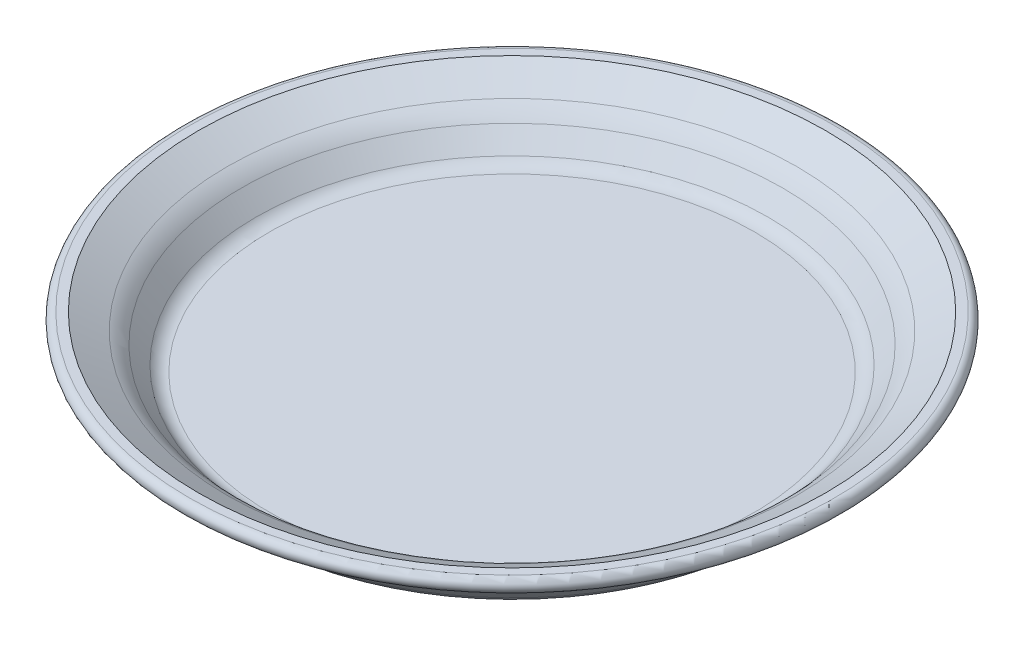
ISO-10303-21;
HEADER;
FILE_DESCRIPTION(('STEP AP214'),'2;1');
FILE_NAME('part.step','',(''),(''),'','','');
FILE_SCHEMA(('AUTOMOTIVE_DESIGN { 1 0 10303 214 1 1 1 1 }'));
ENDSEC;
DATA;
#1=APPLICATION_CONTEXT('core data for automotive mechanical design processes');
#2=APPLICATION_PROTOCOL_DEFINITION('international standard','automotive_design',2000,#1);
#3=PRODUCT_CONTEXT('',#1,'mechanical');
#4=PRODUCT('Part','Part','',(#3));
#5=PRODUCT_RELATED_PRODUCT_CATEGORY('part','',(#4));
#6=PRODUCT_DEFINITION_FORMATION('','',#4);
#7=PRODUCT_DEFINITION_CONTEXT('part definition',#1,'design');
#8=PRODUCT_DEFINITION('design','',#6,#7);
#9=PRODUCT_DEFINITION_SHAPE('','',#8);
#10=(LENGTH_UNIT() NAMED_UNIT(*) SI_UNIT(.MILLI.,.METRE.));
#11=(NAMED_UNIT(*) PLANE_ANGLE_UNIT() SI_UNIT($,.RADIAN.));
#12=(NAMED_UNIT(*) SI_UNIT($,.STERADIAN.) SOLID_ANGLE_UNIT());
#13=UNCERTAINTY_MEASURE_WITH_UNIT(LENGTH_MEASURE(1.E-05),#10,'distance_accuracy_value','');
#14=(GEOMETRIC_REPRESENTATION_CONTEXT(3) GLOBAL_UNCERTAINTY_ASSIGNED_CONTEXT((#13)) GLOBAL_UNIT_ASSIGNED_CONTEXT((#10,
#11,#12)) REPRESENTATION_CONTEXT('',''));
#15=CARTESIAN_POINT('',(0.,0.,0.));
#16=DIRECTION('',(0.,0.,1.));
#17=DIRECTION('',(1.,0.,0.));
#18=AXIS2_PLACEMENT_3D('',#15,#16,#17);
#19=CARTESIAN_POINT('',(0.,0.,0.));
#20=DIRECTION('',(0.,1.,0.));
#21=DIRECTION('',(0.,0.,1.));
#22=AXIS2_PLACEMENT_3D('',#19,#20,#21);
#23=CONICAL_SURFACE('',#22,100.,1.0471975511966);
#24=CARTESIAN_POINT('',(0.,-3.73205080756888,0.));
#25=DIRECTION('',(0.,-1.,0.));
#26=DIRECTION('',(0.,0.,-1.));
#27=AXIS2_PLACEMENT_3D('',#24,#25,#26);
#28=CIRCLE('',#27,93.5358983848622);
#29=CARTESIAN_POINT('',(0.,-3.73205080756888,-93.5358983848622));
#30=VERTEX_POINT('',#29);
#31=EDGE_CURVE('E10',#30,#30,#28,.T.);
#32=ORIENTED_EDGE('',*,*,#31,.T.);
#33=EDGE_LOOP('',(#32));
#34=FACE_BOUND('',#33,.T.);
#35=CARTESIAN_POINT('',(0.,-9.11836509645769,0.));
#36=DIRECTION('',(0.,-1.,0.));
#37=DIRECTION('',(0.,0.,-1.));
#38=AXIS2_PLACEMENT_3D('',#35,#36,#37);
#39=CIRCLE('',#38,84.2065283709725);
#40=CARTESIAN_POINT('',(0.,-9.11836509645769,-84.2065283709725));
#41=VERTEX_POINT('',#40);
#42=EDGE_CURVE('E48',#41,#41,#39,.F.);
#43=ORIENTED_EDGE('',*,*,#42,.T.);
#44=EDGE_LOOP('',(#43));
#45=FACE_BOUND('',#44,.T.);
#46=ADVANCED_FACE('F33',(#34,#45),#23,.T.);
#47=CARTESIAN_POINT('',(0.,0.,0.));
#48=DIRECTION('',(0.,1.,0.));
#49=DIRECTION('',(0.,0.,1.));
#50=AXIS2_PLACEMENT_3D('',#47,#48,#49);
#51=PLANE('',#50);
#52=CARTESIAN_POINT('',(0.,0.,0.));
#53=DIRECTION('',(0.,1.,0.));
#54=DIRECTION('',(0.,0.,1.));
#55=AXIS2_PLACEMENT_3D('',#52,#53,#54);
#56=CIRCLE('',#55,90.);
#57=CARTESIAN_POINT('',(0.,0.,90.));
#58=VERTEX_POINT('',#57);
#59=EDGE_CURVE('E59',#58,#58,#56,.T.);
#60=ORIENTED_EDGE('',*,*,#59,.F.);
#61=EDGE_LOOP('',(#60));
#62=FACE_BOUND('',#61,.T.);
#63=CARTESIAN_POINT('',(0.,0.,0.));
#64=DIRECTION('',(0.,1.,0.));
#65=DIRECTION('',(0.,0.,1.));
#66=AXIS2_PLACEMENT_3D('',#63,#64,#65);
#67=CIRCLE('',#66,92.5358983848622);
#68=CARTESIAN_POINT('',(0.,0.,92.5358983848622));
#69=VERTEX_POINT('',#68);
#70=EDGE_CURVE('E40',#69,#69,#67,.T.);
#71=ORIENTED_EDGE('',*,*,#70,.T.);
#72=EDGE_LOOP('',(#71));
#73=FACE_BOUND('',#72,.T.);
#74=ADVANCED_FACE('F93',(#62,#73),#51,.T.);
#75=CARTESIAN_POINT('',(0.,-10.,0.));
#76=DIRECTION('',(0.,1.,0.));
#77=DIRECTION('',(0.,0.,-1.));
#78=AXIS2_PLACEMENT_3D('',#75,#76,#77);
#79=CONICAL_SURFACE('',#78,82.6794919243111,0.698131700797733);
#80=CARTESIAN_POINT('',(0.,-11.3507430374367,0.));
#81=DIRECTION('',(0.,-1.,0.));
#82=DIRECTION('',(0.,0.,-1.));
#83=AXIS2_PLACEMENT_3D('',#80,#81,#82);
#84=CIRCLE('',#83,81.5460839397827);
#85=CARTESIAN_POINT('',(0.,-11.3507430374367,-81.5460839397827));
#86=VERTEX_POINT('',#85);
#87=EDGE_CURVE('E53',#86,#86,#84,.T.);
#88=ORIENTED_EDGE('',*,*,#87,.T.);
#89=EDGE_LOOP('',(#88));
#90=FACE_BOUND('',#89,.T.);
#91=CARTESIAN_POINT('',(0.,-16.4278760968654,0.));
#92=DIRECTION('',(0.,1.,0.));
#93=DIRECTION('',(0.,0.,1.));
#94=AXIS2_PLACEMENT_3D('',#91,#92,#93);
#95=CIRCLE('',#94,77.2858634621781);
#96=CARTESIAN_POINT('',(0.,-16.4278760968654,77.2858634621781));
#97=VERTEX_POINT('',#96);
#98=EDGE_CURVE('E56',#97,#97,#95,.T.);
#99=ORIENTED_EDGE('',*,*,#98,.T.);
#100=EDGE_LOOP('',(#99));
#101=FACE_BOUND('',#100,.T.);
#102=ADVANCED_FACE('F98',(#90,#101),#79,.T.);
#103=CARTESIAN_POINT('',(0.,-20.,0.));
#104=DIRECTION('',(0.,-1.,0.));
#105=DIRECTION('',(0.,0.,-1.));
#106=AXIS2_PLACEMENT_3D('',#103,#104,#105);
#107=PLANE('',#106);
#108=CARTESIAN_POINT('',(0.,-20.,0.));
#109=DIRECTION('',(0.,-1.,0.));
#110=DIRECTION('',(0.,0.,-1.));
#111=AXIS2_PLACEMENT_3D('',#108,#109,#110);
#112=CIRCLE('',#111,69.6254190309883);
#113=CARTESIAN_POINT('',(0.,-20.,-69.6254190309883));
#114=VERTEX_POINT('',#113);
#115=EDGE_CURVE('E44',#114,#114,#112,.T.);
#116=ORIENTED_EDGE('',*,*,#115,.T.);
#117=EDGE_LOOP('',(#116));
#118=FACE_BOUND('',#117,.T.);
#119=ADVANCED_FACE('F106',(#118),#107,.T.);
#120=CARTESIAN_POINT('',(0.,-17.7786191343021,0.));
#121=DIRECTION('',(0.,-1.,0.));
#122=DIRECTION('',(0.,0.,-1.));
#123=AXIS2_PLACEMENT_3D('',#120,#121,#122);
#124=TOROIDAL_SURFACE('',#123,89.2065283709725,10.);
#125=ORIENTED_EDGE('',*,*,#42,.F.);
#126=EDGE_LOOP('',(#125));
#127=FACE_BOUND('',#126,.T.);
#128=ORIENTED_EDGE('',*,*,#87,.F.);
#129=EDGE_LOOP('',(#128));
#130=FACE_BOUND('',#129,.T.);
#131=ADVANCED_FACE('F104',(#127,#130),#124,.F.);
#132=CARTESIAN_POINT('',(0.,-10.,0.));
#133=DIRECTION('',(0.,-1.,0.));
#134=DIRECTION('',(0.,0.,-1.));
#135=AXIS2_PLACEMENT_3D('',#132,#133,#134);
#136=TOROIDAL_SURFACE('',#135,69.6254190309883,10.);
#137=ORIENTED_EDGE('',*,*,#98,.F.);
#138=EDGE_LOOP('',(#137));
#139=FACE_BOUND('',#138,.T.);
#140=ORIENTED_EDGE('',*,*,#115,.F.);
#141=EDGE_LOOP('',(#140));
#142=FACE_BOUND('',#141,.T.);
#143=ADVANCED_FACE('F90',(#139,#142),#136,.T.);
#144=CARTESIAN_POINT('',(0.,-2.,0.));
#145=DIRECTION('',(0.,1.,0.));
#146=DIRECTION('',(0.,0.,1.));
#147=AXIS2_PLACEMENT_3D('',#144,#145,#146);
#148=TOROIDAL_SURFACE('',#147,92.5358983848622,2.);
#149=ORIENTED_EDGE('',*,*,#31,.F.);
#150=EDGE_LOOP('',(#149));
#151=FACE_BOUND('',#150,.T.);
#152=ORIENTED_EDGE('',*,*,#70,.F.);
#153=EDGE_LOOP('',(#152));
#154=FACE_BOUND('',#153,.T.);
#155=ADVANCED_FACE('F35',(#151,#154),#148,.T.);
#156=CARTESIAN_POINT('',(0.,4.3301270189222,0.));
#157=DIRECTION('',(0.,1.,0.));
#158=DIRECTION('',(0.,0.,1.));
#159=AXIS2_PLACEMENT_3D('',#156,#157,#158);
#160=CONICAL_SURFACE('',#159,97.5,1.0471975511966);
#161=ORIENTED_EDGE('',*,*,#59,.T.);
#162=EDGE_LOOP('',(#161));
#163=FACE_BOUND('',#162,.T.);
#164=CARTESIAN_POINT('',(0.,-4.7882380775355,0.));
#165=DIRECTION('',(0.,1.,0.));
#166=DIRECTION('',(0.,0.,1.));
#167=AXIS2_PLACEMENT_3D('',#164,#165,#166);
#168=CIRCLE('',#167,81.7065283709725);
#169=CARTESIAN_POINT('',(0.,-4.7882380775355,81.7065283709725));
#170=VERTEX_POINT('',#169);
#171=EDGE_CURVE('E65',#170,#170,#168,.T.);
#172=ORIENTED_EDGE('',*,*,#171,.F.);
#173=EDGE_LOOP('',(#172));
#174=FACE_BOUND('',#173,.T.);
#175=ADVANCED_FACE('F78',(#163,#174),#160,.F.);
#176=CARTESIAN_POINT('',(0.,-6.7860619515673,0.));
#177=DIRECTION('',(0.,1.,0.));
#178=DIRECTION('',(0.,0.,-1.));
#179=AXIS2_PLACEMENT_3D('',#176,#177,#178);
#180=CONICAL_SURFACE('',#179,78.8492697087162,0.698131700797733);
#181=CARTESIAN_POINT('',(0.,-8.13680498900398,0.));
#182=DIRECTION('',(0.,1.,0.));
#183=DIRECTION('',(0.,0.,1.));
#184=AXIS2_PLACEMENT_3D('',#181,#182,#183);
#185=CIRCLE('',#184,77.7158617241879);
#186=CARTESIAN_POINT('',(0.,-8.13680498900398,77.7158617241879));
#187=VERTEX_POINT('',#186);
#188=EDGE_CURVE('E69',#187,#187,#185,.F.);
#189=ORIENTED_EDGE('',*,*,#188,.F.);
#190=EDGE_LOOP('',(#189));
#191=FACE_BOUND('',#190,.T.);
#192=CARTESIAN_POINT('',(0.,-13.2139380484327,0.));
#193=DIRECTION('',(0.,1.,0.));
#194=DIRECTION('',(0.,0.,1.));
#195=AXIS2_PLACEMENT_3D('',#192,#193,#194);
#196=CIRCLE('',#195,73.4556412465832);
#197=CARTESIAN_POINT('',(0.,-13.2139380484327,73.4556412465832));
#198=VERTEX_POINT('',#197);
#199=EDGE_CURVE('E66',#198,#198,#196,.T.);
#200=ORIENTED_EDGE('',*,*,#199,.F.);
#201=EDGE_LOOP('',(#200));
#202=FACE_BOUND('',#201,.T.);
#203=ADVANCED_FACE('F80',(#191,#202),#180,.F.);
#204=CARTESIAN_POINT('',(0.,-15.,0.));
#205=DIRECTION('',(0.,-1.,0.));
#206=DIRECTION('',(0.,0.,-1.));
#207=AXIS2_PLACEMENT_3D('',#204,#205,#206);
#208=PLANE('',#207);
#209=CARTESIAN_POINT('',(0.,-15.,0.));
#210=DIRECTION('',(0.,-1.,0.));
#211=DIRECTION('',(0.,0.,-1.));
#212=AXIS2_PLACEMENT_3D('',#209,#210,#211);
#213=CIRCLE('',#212,69.6254190309883);
#214=CARTESIAN_POINT('',(0.,-15.,-69.6254190309883));
#215=VERTEX_POINT('',#214);
#216=EDGE_CURVE('E62',#215,#215,#213,.T.);
#217=ORIENTED_EDGE('',*,*,#216,.F.);
#218=EDGE_LOOP('',(#217));
#219=FACE_BOUND('',#218,.T.);
#220=ADVANCED_FACE('F87',(#219),#208,.F.);
#221=CARTESIAN_POINT('',(0.,-17.7786191343021,0.));
#222=DIRECTION('',(0.,-1.,0.));
#223=DIRECTION('',(0.,0.,-1.));
#224=AXIS2_PLACEMENT_3D('',#221,#222,#223);
#225=TOROIDAL_SURFACE('',#224,89.2065283709725,15.);
#226=ORIENTED_EDGE('',*,*,#171,.T.);
#227=EDGE_LOOP('',(#226));
#228=FACE_BOUND('',#227,.T.);
#229=ORIENTED_EDGE('',*,*,#188,.T.);
#230=EDGE_LOOP('',(#229));
#231=FACE_BOUND('',#230,.T.);
#232=ADVANCED_FACE('F75',(#228,#231),#225,.T.);
#233=CARTESIAN_POINT('',(0.,-10.,0.));
#234=DIRECTION('',(0.,-1.,0.));
#235=DIRECTION('',(0.,0.,-1.));
#236=AXIS2_PLACEMENT_3D('',#233,#234,#235);
#237=TOROIDAL_SURFACE('',#236,69.6254190309883,5.);
#238=ORIENTED_EDGE('',*,*,#199,.T.);
#239=EDGE_LOOP('',(#238));
#240=FACE_BOUND('',#239,.T.);
#241=ORIENTED_EDGE('',*,*,#216,.T.);
#242=EDGE_LOOP('',(#241));
#243=FACE_BOUND('',#242,.T.);
#244=ADVANCED_FACE('F123',(#240,#243),#237,.F.);
#245=CLOSED_SHELL('',(#46,#74,#102,#119,#131,#143,#155,#175,#203,#220,#232,#244));
#246=MANIFOLD_SOLID_BREP('B2',#245);
#247=ADVANCED_BREP_SHAPE_REPRESENTATION('',(#18,#246),#14);
#248=SHAPE_DEFINITION_REPRESENTATION(#9,#247);
ENDSEC;
END-ISO-10303-21;
